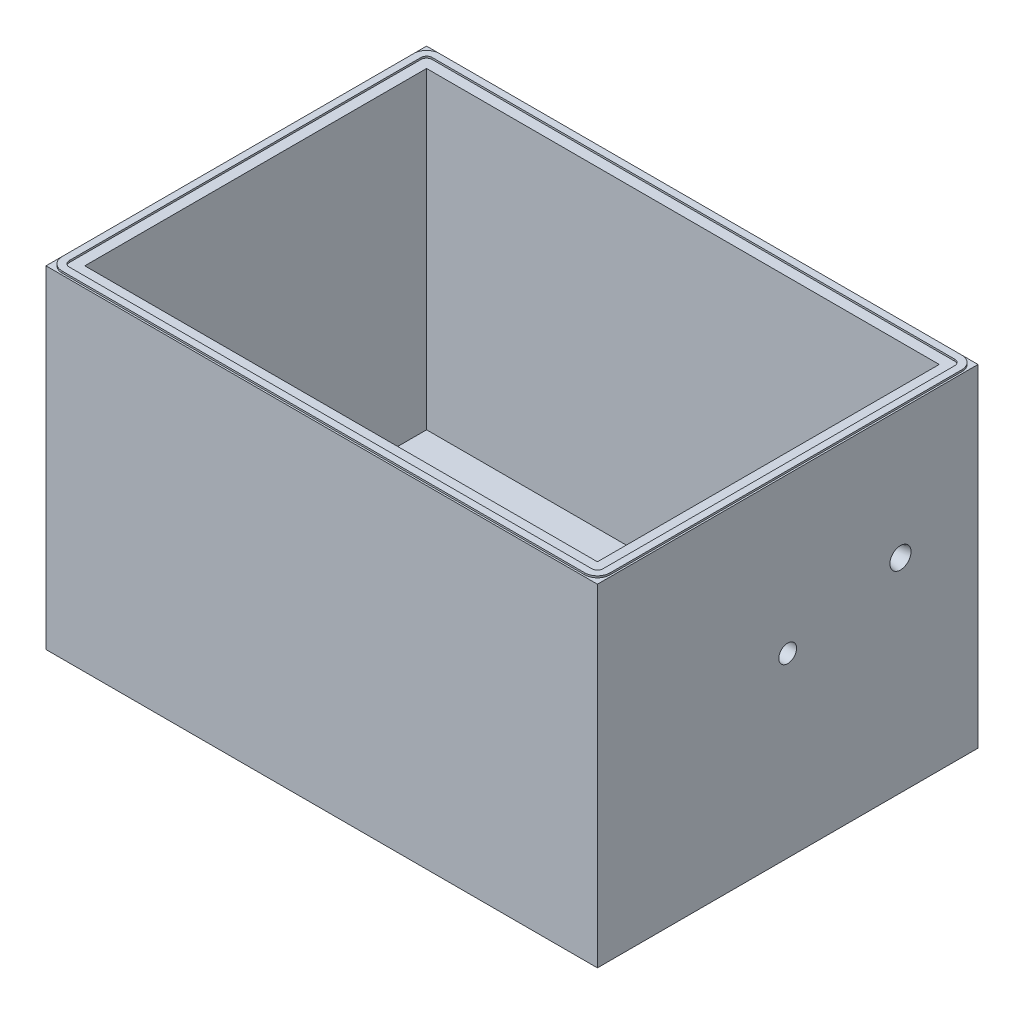
ISO-10303-21;
HEADER;
FILE_DESCRIPTION(('STEP AP214'),'2;1');
FILE_NAME('part.step','',(''),(''),'','','');
FILE_SCHEMA(('AUTOMOTIVE_DESIGN { 1 0 10303 214 1 1 1 1 }'));
ENDSEC;
DATA;
#1=APPLICATION_CONTEXT('core data for automotive mechanical design processes');
#2=APPLICATION_PROTOCOL_DEFINITION('international standard','automotive_design',2000,#1);
#3=PRODUCT_CONTEXT('',#1,'mechanical');
#4=PRODUCT('Part','Part','',(#3));
#5=PRODUCT_RELATED_PRODUCT_CATEGORY('part','',(#4));
#6=PRODUCT_DEFINITION_FORMATION('','',#4);
#7=PRODUCT_DEFINITION_CONTEXT('part definition',#1,'design');
#8=PRODUCT_DEFINITION('design','',#6,#7);
#9=PRODUCT_DEFINITION_SHAPE('','',#8);
#10=(LENGTH_UNIT() NAMED_UNIT(*) SI_UNIT(.MILLI.,.METRE.));
#11=(NAMED_UNIT(*) PLANE_ANGLE_UNIT() SI_UNIT($,.RADIAN.));
#12=(NAMED_UNIT(*) SI_UNIT($,.STERADIAN.) SOLID_ANGLE_UNIT());
#13=UNCERTAINTY_MEASURE_WITH_UNIT(LENGTH_MEASURE(1.E-05),#10,'distance_accuracy_value','');
#14=(GEOMETRIC_REPRESENTATION_CONTEXT(3) GLOBAL_UNCERTAINTY_ASSIGNED_CONTEXT((#13)) GLOBAL_UNIT_ASSIGNED_CONTEXT((#10,
#11,#12)) REPRESENTATION_CONTEXT('',''));
#15=CARTESIAN_POINT('',(0.,0.,0.));
#16=DIRECTION('',(0.,0.,1.));
#17=DIRECTION('',(1.,0.,0.));
#18=AXIS2_PLACEMENT_3D('',#15,#16,#17);
#19=CARTESIAN_POINT('',(0.,301.,0.));
#20=DIRECTION('',(0.,-1.,0.));
#21=DIRECTION('',(0.,0.,-1.));
#22=AXIS2_PLACEMENT_3D('',#19,#20,#21);
#23=PLANE('',#22);
#24=DIRECTION('',(-1.,0.,0.));
#25=VECTOR('',#24,1.);
#26=CARTESIAN_POINT('',(235.3945,301.,-163.5125));
#27=LINE('',#26,#25);
#28=CARTESIAN_POINT('',(235.3945,301.,-163.5125));
#29=VERTEX_POINT('',#28);
#30=CARTESIAN_POINT('',(-235.3945,301.,-163.5125));
#31=VERTEX_POINT('',#30);
#32=EDGE_CURVE('E330',#29,#31,#27,.T.);
#33=ORIENTED_EDGE('',*,*,#32,.F.);
#34=CARTESIAN_POINT('',(235.3945,301.,-158.4325));
#35=DIRECTION('',(0.,1.,0.));
#36=DIRECTION('',(0.,0.,-1.));
#37=AXIS2_PLACEMENT_3D('',#34,#35,#36);
#38=CIRCLE('',#37,5.08);
#39=CARTESIAN_POINT('',(240.4745,301.,-158.4325));
#40=VERTEX_POINT('',#39);
#41=EDGE_CURVE('E302',#40,#29,#38,.T.);
#42=ORIENTED_EDGE('',*,*,#41,.F.);
#43=DIRECTION('',(0.,0.,-1.));
#44=VECTOR('',#43,1.);
#45=CARTESIAN_POINT('',(240.4745,301.,158.4325));
#46=LINE('',#45,#44);
#47=CARTESIAN_POINT('',(240.4745,301.,158.4325));
#48=VERTEX_POINT('',#47);
#49=EDGE_CURVE('E307',#48,#40,#46,.T.);
#50=ORIENTED_EDGE('',*,*,#49,.F.);
#51=CARTESIAN_POINT('',(235.3945,301.,158.4325));
#52=DIRECTION('',(0.,1.,0.));
#53=DIRECTION('',(0.,0.,1.));
#54=AXIS2_PLACEMENT_3D('',#51,#52,#53);
#55=CIRCLE('',#54,5.07999999999997);
#56=CARTESIAN_POINT('',(235.3945,301.,163.5125));
#57=VERTEX_POINT('',#56);
#58=EDGE_CURVE('E345',#57,#48,#55,.T.);
#59=ORIENTED_EDGE('',*,*,#58,.F.);
#60=DIRECTION('',(1.,0.,0.));
#61=VECTOR('',#60,1.);
#62=CARTESIAN_POINT('',(-235.3945,301.,163.5125));
#63=LINE('',#62,#61);
#64=CARTESIAN_POINT('',(-235.3945,301.,163.5125));
#65=VERTEX_POINT('',#64);
#66=EDGE_CURVE('E342',#65,#57,#63,.T.);
#67=ORIENTED_EDGE('',*,*,#66,.F.);
#68=CARTESIAN_POINT('',(-235.3945,301.,158.4325));
#69=DIRECTION('',(0.,1.,0.));
#70=DIRECTION('',(0.,0.,1.));
#71=AXIS2_PLACEMENT_3D('',#68,#69,#70);
#72=CIRCLE('',#71,5.08);
#73=CARTESIAN_POINT('',(-240.4745,301.,158.4325));
#74=VERTEX_POINT('',#73);
#75=EDGE_CURVE('E339',#74,#65,#72,.T.);
#76=ORIENTED_EDGE('',*,*,#75,.F.);
#77=DIRECTION('',(0.,0.,1.));
#78=VECTOR('',#77,1.);
#79=CARTESIAN_POINT('',(-240.4745,301.,-158.4325));
#80=LINE('',#79,#78);
#81=CARTESIAN_POINT('',(-240.4745,301.,-158.4325));
#82=VERTEX_POINT('',#81);
#83=EDGE_CURVE('E336',#82,#74,#80,.T.);
#84=ORIENTED_EDGE('',*,*,#83,.F.);
#85=CARTESIAN_POINT('',(-235.3945,301.,-158.4325));
#86=DIRECTION('',(0.,1.,0.));
#87=DIRECTION('',(0.,0.,1.));
#88=AXIS2_PLACEMENT_3D('',#85,#86,#87);
#89=CIRCLE('',#88,5.08000000000002);
#90=EDGE_CURVE('E333',#31,#82,#89,.T.);
#91=ORIENTED_EDGE('',*,*,#90,.F.);
#92=EDGE_LOOP('',(#33,#42,#50,#59,#67,#76,#84,#91));
#93=FACE_BOUND('',#92,.T.);
#94=CARTESIAN_POINT('',(235.3945,301.,158.4325));
#95=DIRECTION('',(0.,1.,0.));
#96=DIRECTION('',(0.,0.,1.));
#97=AXIS2_PLACEMENT_3D('',#94,#95,#96);
#98=CIRCLE('',#97,11.43);
#99=CARTESIAN_POINT('',(235.3945,301.,169.8625));
#100=VERTEX_POINT('',#99);
#101=CARTESIAN_POINT('',(246.8245,301.,158.4325));
#102=VERTEX_POINT('',#101);
#103=EDGE_CURVE('E250',#100,#102,#98,.T.);
#104=ORIENTED_EDGE('',*,*,#103,.T.);
#105=DIRECTION('',(0.,0.,-1.));
#106=VECTOR('',#105,1.);
#107=CARTESIAN_POINT('',(246.8245,301.,158.4325));
#108=LINE('',#107,#106);
#109=CARTESIAN_POINT('',(246.8245,301.,-158.4325));
#110=VERTEX_POINT('',#109);
#111=EDGE_CURVE('E207',#102,#110,#108,.T.);
#112=ORIENTED_EDGE('',*,*,#111,.T.);
#113=CARTESIAN_POINT('',(235.3945,301.,-158.4325));
#114=DIRECTION('',(0.,1.,0.));
#115=DIRECTION('',(0.,0.,1.));
#116=AXIS2_PLACEMENT_3D('',#113,#114,#115);
#117=CIRCLE('',#116,11.43);
#118=CARTESIAN_POINT('',(235.3945,301.,-169.8625));
#119=VERTEX_POINT('',#118);
#120=EDGE_CURVE('E64',#110,#119,#117,.T.);
#121=ORIENTED_EDGE('',*,*,#120,.T.);
#122=DIRECTION('',(-1.,0.,0.));
#123=VECTOR('',#122,1.);
#124=CARTESIAN_POINT('',(235.3945,301.,-169.8625));
#125=LINE('',#124,#123);
#126=CARTESIAN_POINT('',(-235.3945,301.,-169.8625));
#127=VERTEX_POINT('',#126);
#128=EDGE_CURVE('E254',#119,#127,#125,.T.);
#129=ORIENTED_EDGE('',*,*,#128,.T.);
#130=CARTESIAN_POINT('',(-235.3945,301.,-158.4325));
#131=DIRECTION('',(0.,1.,0.));
#132=DIRECTION('',(0.,0.,1.));
#133=AXIS2_PLACEMENT_3D('',#130,#131,#132);
#134=CIRCLE('',#133,11.43);
#135=CARTESIAN_POINT('',(-246.8245,301.,-158.4325));
#136=VERTEX_POINT('',#135);
#137=EDGE_CURVE('E257',#127,#136,#134,.T.);
#138=ORIENTED_EDGE('',*,*,#137,.T.);
#139=DIRECTION('',(0.,0.,1.));
#140=VECTOR('',#139,1.);
#141=CARTESIAN_POINT('',(-246.8245,301.,-158.4325));
#142=LINE('',#141,#140);
#143=CARTESIAN_POINT('',(-246.8245,301.,158.4325));
#144=VERTEX_POINT('',#143);
#145=EDGE_CURVE('E260',#136,#144,#142,.T.);
#146=ORIENTED_EDGE('',*,*,#145,.T.);
#147=CARTESIAN_POINT('',(-235.3945,301.,158.4325));
#148=DIRECTION('',(0.,1.,0.));
#149=DIRECTION('',(0.,0.,1.));
#150=AXIS2_PLACEMENT_3D('',#147,#148,#149);
#151=CIRCLE('',#150,11.43);
#152=CARTESIAN_POINT('',(-235.3945,301.,169.8625));
#153=VERTEX_POINT('',#152);
#154=EDGE_CURVE('E230',#144,#153,#151,.T.);
#155=ORIENTED_EDGE('',*,*,#154,.T.);
#156=DIRECTION('',(1.,0.,0.));
#157=VECTOR('',#156,1.);
#158=CARTESIAN_POINT('',(-235.3945,301.,169.8625));
#159=LINE('',#158,#157);
#160=EDGE_CURVE('E227',#153,#100,#159,.T.);
#161=ORIENTED_EDGE('',*,*,#160,.T.);
#162=EDGE_LOOP('',(#104,#112,#121,#129,#138,#146,#155,#161));
#163=FACE_BOUND('',#162,.T.);
#164=ADVANCED_FACE('F41',(#93,#163),#23,.F.);
#165=CARTESIAN_POINT('',(248.412,17.4625,171.45));
#166=DIRECTION('',(-1.,0.,0.));
#167=DIRECTION('',(0.,0.,1.));
#168=AXIS2_PLACEMENT_3D('',#165,#166,#167);
#169=PLANE('',#168);
#170=CARTESIAN_POINT('',(248.412,159.7125,0.));
#171=DIRECTION('',(1.,0.,0.));
#172=DIRECTION('',(0.,0.,-1.));
#173=AXIS2_PLACEMENT_3D('',#170,#171,#172);
#174=CIRCLE('',#173,8.001);
#175=CARTESIAN_POINT('',(248.412,159.7125,-8.00100000000002));
#176=VERTEX_POINT('',#175);
#177=EDGE_CURVE('E433',#176,#176,#174,.T.);
#178=ORIENTED_EDGE('',*,*,#177,.F.);
#179=EDGE_LOOP('',(#178));
#180=FACE_BOUND('',#179,.T.);
#181=CARTESIAN_POINT('',(248.412,183.525,-101.6));
#182=DIRECTION('',(1.,0.,0.));
#183=DIRECTION('',(0.,0.,-1.));
#184=AXIS2_PLACEMENT_3D('',#181,#182,#183);
#185=CIRCLE('',#184,9.525);
#186=CARTESIAN_POINT('',(248.412,183.525,-111.125));
#187=VERTEX_POINT('',#186);
#188=EDGE_CURVE('E284',#187,#187,#185,.T.);
#189=ORIENTED_EDGE('',*,*,#188,.F.);
#190=EDGE_LOOP('',(#189));
#191=FACE_BOUND('',#190,.T.);
#192=DIRECTION('',(0.,-1.,0.));
#193=VECTOR('',#192,1.);
#194=CARTESIAN_POINT('',(248.412,17.4625,-171.45));
#195=LINE('',#194,#193);
#196=CARTESIAN_POINT('',(248.412,299.4125,-171.45));
#197=VERTEX_POINT('',#196);
#198=CARTESIAN_POINT('',(248.412,0.,-171.45));
#199=VERTEX_POINT('',#198);
#200=EDGE_CURVE('E11',#197,#199,#195,.T.);
#201=ORIENTED_EDGE('',*,*,#200,.F.);
#202=DIRECTION('',(0.,0.,-1.));
#203=VECTOR('',#202,1.);
#204=CARTESIAN_POINT('',(248.412,299.4125,-171.45));
#205=LINE('',#204,#203);
#206=CARTESIAN_POINT('',(248.412,299.4125,171.45));
#207=VERTEX_POINT('',#206);
#208=EDGE_CURVE('E279',#207,#197,#205,.T.);
#209=ORIENTED_EDGE('',*,*,#208,.F.);
#210=DIRECTION('',(0.,-1.,0.));
#211=VECTOR('',#210,1.);
#212=CARTESIAN_POINT('',(248.412,17.4625,171.45));
#213=LINE('',#212,#211);
#214=CARTESIAN_POINT('',(248.412,0.,171.45));
#215=VERTEX_POINT('',#214);
#216=EDGE_CURVE('E398',#207,#215,#213,.T.);
#217=ORIENTED_EDGE('',*,*,#216,.T.);
#218=DIRECTION('',(0.,0.,-1.));
#219=VECTOR('',#218,1.);
#220=CARTESIAN_POINT('',(248.412,0.,171.45));
#221=LINE('',#220,#219);
#222=EDGE_CURVE('E386',#215,#199,#221,.T.);
#223=ORIENTED_EDGE('',*,*,#222,.T.);
#224=EDGE_LOOP('',(#201,#209,#217,#223));
#225=FACE_BOUND('',#224,.T.);
#226=ADVANCED_FACE('F43',(#180,#191,#225),#169,.F.);
#227=CARTESIAN_POINT('',(-248.412,17.4625,-171.45));
#228=DIRECTION('',(0.,0.,1.));
#229=DIRECTION('',(1.,0.,0.));
#230=AXIS2_PLACEMENT_3D('',#227,#228,#229);
#231=PLANE('',#230);
#232=DIRECTION('',(0.,-1.,0.));
#233=VECTOR('',#232,1.);
#234=CARTESIAN_POINT('',(-248.412,17.4625,-171.45));
#235=LINE('',#234,#233);
#236=CARTESIAN_POINT('',(-248.412,299.4125,-171.45));
#237=VERTEX_POINT('',#236);
#238=CARTESIAN_POINT('',(-248.412,0.,-171.45));
#239=VERTEX_POINT('',#238);
#240=EDGE_CURVE('E49',#237,#239,#235,.T.);
#241=ORIENTED_EDGE('',*,*,#240,.F.);
#242=DIRECTION('',(-1.,0.,0.));
#243=VECTOR('',#242,1.);
#244=CARTESIAN_POINT('',(-248.412,299.4125,-171.45));
#245=LINE('',#244,#243);
#246=EDGE_CURVE('E281',#197,#237,#245,.T.);
#247=ORIENTED_EDGE('',*,*,#246,.F.);
#248=ORIENTED_EDGE('',*,*,#200,.T.);
#249=DIRECTION('',(-1.,0.,0.));
#250=VECTOR('',#249,1.);
#251=CARTESIAN_POINT('',(-248.412,0.,-171.45));
#252=LINE('',#251,#250);
#253=EDGE_CURVE('E389',#199,#239,#252,.T.);
#254=ORIENTED_EDGE('',*,*,#253,.T.);
#255=EDGE_LOOP('',(#241,#247,#248,#254));
#256=FACE_BOUND('',#255,.T.);
#257=ADVANCED_FACE('F410',(#256),#231,.F.);
#258=CARTESIAN_POINT('',(-248.412,17.4625,171.45));
#259=DIRECTION('',(1.,0.,0.));
#260=DIRECTION('',(0.,0.,-1.));
#261=AXIS2_PLACEMENT_3D('',#258,#259,#260);
#262=PLANE('',#261);
#263=DIRECTION('',(0.,-1.,0.));
#264=VECTOR('',#263,1.);
#265=CARTESIAN_POINT('',(-248.412,17.4625,171.45));
#266=LINE('',#265,#264);
#267=CARTESIAN_POINT('',(-248.412,299.4125,171.45));
#268=VERTEX_POINT('',#267);
#269=CARTESIAN_POINT('',(-248.412,0.,171.45));
#270=VERTEX_POINT('',#269);
#271=EDGE_CURVE('E400',#268,#270,#266,.T.);
#272=ORIENTED_EDGE('',*,*,#271,.F.);
#273=DIRECTION('',(0.,0.,1.));
#274=VECTOR('',#273,1.);
#275=CARTESIAN_POINT('',(-248.412,299.4125,171.45));
#276=LINE('',#275,#274);
#277=EDGE_CURVE('E56',#237,#268,#276,.T.);
#278=ORIENTED_EDGE('',*,*,#277,.F.);
#279=ORIENTED_EDGE('',*,*,#240,.T.);
#280=DIRECTION('',(0.,0.,1.));
#281=VECTOR('',#280,1.);
#282=CARTESIAN_POINT('',(-248.412,0.,171.45));
#283=LINE('',#282,#281);
#284=EDGE_CURVE('E392',#239,#270,#283,.T.);
#285=ORIENTED_EDGE('',*,*,#284,.T.);
#286=EDGE_LOOP('',(#272,#278,#279,#285));
#287=FACE_BOUND('',#286,.T.);
#288=ADVANCED_FACE('F404',(#287),#262,.F.);
#289=CARTESIAN_POINT('',(-248.412,17.4625,171.45));
#290=DIRECTION('',(0.,0.,-1.));
#291=DIRECTION('',(-1.,0.,0.));
#292=AXIS2_PLACEMENT_3D('',#289,#290,#291);
#293=PLANE('',#292);
#294=ORIENTED_EDGE('',*,*,#216,.F.);
#295=DIRECTION('',(1.,0.,0.));
#296=VECTOR('',#295,1.);
#297=CARTESIAN_POINT('',(248.412,299.4125,171.45));
#298=LINE('',#297,#296);
#299=EDGE_CURVE('E266',#268,#207,#298,.T.);
#300=ORIENTED_EDGE('',*,*,#299,.F.);
#301=ORIENTED_EDGE('',*,*,#271,.T.);
#302=DIRECTION('',(1.,0.,0.));
#303=VECTOR('',#302,1.);
#304=CARTESIAN_POINT('',(-248.412,0.,171.45));
#305=LINE('',#304,#303);
#306=EDGE_CURVE('E395',#270,#215,#305,.T.);
#307=ORIENTED_EDGE('',*,*,#306,.T.);
#308=EDGE_LOOP('',(#294,#300,#301,#307));
#309=FACE_BOUND('',#308,.T.);
#310=ADVANCED_FACE('F417',(#309),#293,.F.);
#311=CARTESIAN_POINT('',(0.,0.,0.));
#312=DIRECTION('',(0.,-1.,0.));
#313=DIRECTION('',(0.,0.,-1.));
#314=AXIS2_PLACEMENT_3D('',#311,#312,#313);
#315=PLANE('',#314);
#316=ORIENTED_EDGE('',*,*,#222,.F.);
#317=ORIENTED_EDGE('',*,*,#306,.F.);
#318=ORIENTED_EDGE('',*,*,#284,.F.);
#319=ORIENTED_EDGE('',*,*,#253,.F.);
#320=EDGE_LOOP('',(#316,#317,#318,#319));
#321=FACE_BOUND('',#320,.T.);
#322=ADVANCED_FACE('F414',(#321),#315,.T.);
#323=CARTESIAN_POINT('',(235.3945,299.4125,-158.4325));
#324=DIRECTION('',(0.,1.,0.));
#325=DIRECTION('',(0.,0.,1.));
#326=AXIS2_PLACEMENT_3D('',#323,#324,#325);
#327=CYLINDRICAL_SURFACE('',#326,5.08);
#328=ORIENTED_EDGE('',*,*,#41,.T.);
#329=DIRECTION('',(0.,1.,0.));
#330=VECTOR('',#329,1.);
#331=CARTESIAN_POINT('',(235.3945,299.4125,-163.5125));
#332=LINE('',#331,#330);
#333=CARTESIAN_POINT('',(235.3945,299.4125,-163.5125));
#334=VERTEX_POINT('',#333);
#335=EDGE_CURVE('E328',#334,#29,#332,.T.);
#336=ORIENTED_EDGE('',*,*,#335,.F.);
#337=CARTESIAN_POINT('',(235.3945,299.4125,-158.4325));
#338=DIRECTION('',(0.,1.,0.));
#339=DIRECTION('',(0.,0.,-1.));
#340=AXIS2_PLACEMENT_3D('',#337,#338,#339);
#341=CIRCLE('',#340,5.08);
#342=CARTESIAN_POINT('',(240.4745,299.4125,-158.4325));
#343=VERTEX_POINT('',#342);
#344=EDGE_CURVE('E303',#343,#334,#341,.T.);
#345=ORIENTED_EDGE('',*,*,#344,.F.);
#346=DIRECTION('',(0.,1.,0.));
#347=VECTOR('',#346,1.);
#348=CARTESIAN_POINT('',(240.4745,299.4125,-158.4325));
#349=LINE('',#348,#347);
#350=EDGE_CURVE('E350',#343,#40,#349,.T.);
#351=ORIENTED_EDGE('',*,*,#350,.T.);
#352=EDGE_LOOP('',(#328,#336,#345,#351));
#353=FACE_BOUND('',#352,.T.);
#354=ADVANCED_FACE('F477',(#353),#327,.F.);
#355=CARTESIAN_POINT('',(240.4745,299.4125,158.4325));
#356=DIRECTION('',(1.,0.,0.));
#357=DIRECTION('',(0.,0.,-1.));
#358=AXIS2_PLACEMENT_3D('',#355,#356,#357);
#359=PLANE('',#358);
#360=ORIENTED_EDGE('',*,*,#49,.T.);
#361=ORIENTED_EDGE('',*,*,#350,.F.);
#362=DIRECTION('',(0.,0.,-1.));
#363=VECTOR('',#362,1.);
#364=CARTESIAN_POINT('',(240.4745,299.4125,158.4325));
#365=LINE('',#364,#363);
#366=CARTESIAN_POINT('',(240.4745,299.4125,158.4325));
#367=VERTEX_POINT('',#366);
#368=EDGE_CURVE('E325',#367,#343,#365,.T.);
#369=ORIENTED_EDGE('',*,*,#368,.F.);
#370=DIRECTION('',(0.,1.,0.));
#371=VECTOR('',#370,1.);
#372=CARTESIAN_POINT('',(240.4745,299.4125,158.4325));
#373=LINE('',#372,#371);
#374=EDGE_CURVE('E353',#367,#48,#373,.T.);
#375=ORIENTED_EDGE('',*,*,#374,.T.);
#376=EDGE_LOOP('',(#360,#361,#369,#375));
#377=FACE_BOUND('',#376,.T.);
#378=ADVANCED_FACE('F596',(#377),#359,.F.);
#379=CARTESIAN_POINT('',(235.3945,299.4125,158.4325));
#380=DIRECTION('',(0.,1.,0.));
#381=DIRECTION('',(0.,0.,1.));
#382=AXIS2_PLACEMENT_3D('',#379,#380,#381);
#383=CYLINDRICAL_SURFACE('',#382,5.07999999999997);
#384=ORIENTED_EDGE('',*,*,#58,.T.);
#385=ORIENTED_EDGE('',*,*,#374,.F.);
#386=CARTESIAN_POINT('',(235.3945,299.4125,158.4325));
#387=DIRECTION('',(0.,1.,0.));
#388=DIRECTION('',(0.,0.,1.));
#389=AXIS2_PLACEMENT_3D('',#386,#387,#388);
#390=CIRCLE('',#389,5.07999999999997);
#391=CARTESIAN_POINT('',(235.3945,299.4125,163.5125));
#392=VERTEX_POINT('',#391);
#393=EDGE_CURVE('E322',#392,#367,#390,.T.);
#394=ORIENTED_EDGE('',*,*,#393,.F.);
#395=DIRECTION('',(0.,1.,0.));
#396=VECTOR('',#395,1.);
#397=CARTESIAN_POINT('',(235.3945,299.4125,163.5125));
#398=LINE('',#397,#396);
#399=EDGE_CURVE('E355',#392,#57,#398,.T.);
#400=ORIENTED_EDGE('',*,*,#399,.T.);
#401=EDGE_LOOP('',(#384,#385,#394,#400));
#402=FACE_BOUND('',#401,.T.);
#403=ADVANCED_FACE('F606',(#402),#383,.F.);
#404=CARTESIAN_POINT('',(-235.3945,299.4125,163.5125));
#405=DIRECTION('',(0.,0.,1.));
#406=DIRECTION('',(1.,0.,0.));
#407=AXIS2_PLACEMENT_3D('',#404,#405,#406);
#408=PLANE('',#407);
#409=ORIENTED_EDGE('',*,*,#66,.T.);
#410=ORIENTED_EDGE('',*,*,#399,.F.);
#411=DIRECTION('',(1.,0.,0.));
#412=VECTOR('',#411,1.);
#413=CARTESIAN_POINT('',(-235.3945,299.4125,163.5125));
#414=LINE('',#413,#412);
#415=CARTESIAN_POINT('',(-235.3945,299.4125,163.5125));
#416=VERTEX_POINT('',#415);
#417=EDGE_CURVE('E319',#416,#392,#414,.T.);
#418=ORIENTED_EDGE('',*,*,#417,.F.);
#419=DIRECTION('',(0.,1.,0.));
#420=VECTOR('',#419,1.);
#421=CARTESIAN_POINT('',(-235.3945,299.4125,163.5125));
#422=LINE('',#421,#420);
#423=EDGE_CURVE('E357',#416,#65,#422,.T.);
#424=ORIENTED_EDGE('',*,*,#423,.T.);
#425=EDGE_LOOP('',(#409,#410,#418,#424));
#426=FACE_BOUND('',#425,.T.);
#427=ADVANCED_FACE('F616',(#426),#408,.F.);
#428=CARTESIAN_POINT('',(-235.3945,299.4125,158.4325));
#429=DIRECTION('',(0.,1.,0.));
#430=DIRECTION('',(0.,0.,1.));
#431=AXIS2_PLACEMENT_3D('',#428,#429,#430);
#432=CYLINDRICAL_SURFACE('',#431,5.08);
#433=ORIENTED_EDGE('',*,*,#75,.T.);
#434=ORIENTED_EDGE('',*,*,#423,.F.);
#435=CARTESIAN_POINT('',(-235.3945,299.4125,158.4325));
#436=DIRECTION('',(0.,1.,0.));
#437=DIRECTION('',(0.,0.,1.));
#438=AXIS2_PLACEMENT_3D('',#435,#436,#437);
#439=CIRCLE('',#438,5.08);
#440=CARTESIAN_POINT('',(-240.4745,299.4125,158.4325));
#441=VERTEX_POINT('',#440);
#442=EDGE_CURVE('E316',#441,#416,#439,.T.);
#443=ORIENTED_EDGE('',*,*,#442,.F.);
#444=DIRECTION('',(0.,1.,0.));
#445=VECTOR('',#444,1.);
#446=CARTESIAN_POINT('',(-240.4745,299.4125,158.4325));
#447=LINE('',#446,#445);
#448=EDGE_CURVE('E359',#441,#74,#447,.T.);
#449=ORIENTED_EDGE('',*,*,#448,.T.);
#450=EDGE_LOOP('',(#433,#434,#443,#449));
#451=FACE_BOUND('',#450,.T.);
#452=ADVANCED_FACE('F626',(#451),#432,.F.);
#453=CARTESIAN_POINT('',(-240.4745,299.4125,-158.4325));
#454=DIRECTION('',(-1.,0.,0.));
#455=DIRECTION('',(0.,0.,1.));
#456=AXIS2_PLACEMENT_3D('',#453,#454,#455);
#457=PLANE('',#456);
#458=ORIENTED_EDGE('',*,*,#83,.T.);
#459=ORIENTED_EDGE('',*,*,#448,.F.);
#460=DIRECTION('',(0.,0.,1.));
#461=VECTOR('',#460,1.);
#462=CARTESIAN_POINT('',(-240.4745,299.4125,-158.4325));
#463=LINE('',#462,#461);
#464=CARTESIAN_POINT('',(-240.4745,299.4125,-158.4325));
#465=VERTEX_POINT('',#464);
#466=EDGE_CURVE('E313',#465,#441,#463,.T.);
#467=ORIENTED_EDGE('',*,*,#466,.F.);
#468=DIRECTION('',(0.,1.,0.));
#469=VECTOR('',#468,1.);
#470=CARTESIAN_POINT('',(-240.4745,299.4125,-158.4325));
#471=LINE('',#470,#469);
#472=EDGE_CURVE('E361',#465,#82,#471,.T.);
#473=ORIENTED_EDGE('',*,*,#472,.T.);
#474=EDGE_LOOP('',(#458,#459,#467,#473));
#475=FACE_BOUND('',#474,.T.);
#476=ADVANCED_FACE('F636',(#475),#457,.F.);
#477=CARTESIAN_POINT('',(-235.3945,299.4125,-158.4325));
#478=DIRECTION('',(0.,1.,0.));
#479=DIRECTION('',(0.,0.,1.));
#480=AXIS2_PLACEMENT_3D('',#477,#478,#479);
#481=CYLINDRICAL_SURFACE('',#480,5.08000000000002);
#482=ORIENTED_EDGE('',*,*,#90,.T.);
#483=ORIENTED_EDGE('',*,*,#472,.F.);
#484=CARTESIAN_POINT('',(-235.3945,299.4125,-158.4325));
#485=DIRECTION('',(0.,1.,0.));
#486=DIRECTION('',(0.,0.,1.));
#487=AXIS2_PLACEMENT_3D('',#484,#485,#486);
#488=CIRCLE('',#487,5.08000000000002);
#489=CARTESIAN_POINT('',(-235.3945,299.4125,-163.5125));
#490=VERTEX_POINT('',#489);
#491=EDGE_CURVE('E310',#490,#465,#488,.T.);
#492=ORIENTED_EDGE('',*,*,#491,.F.);
#493=DIRECTION('',(0.,1.,0.));
#494=VECTOR('',#493,1.);
#495=CARTESIAN_POINT('',(-235.3945,299.4125,-163.5125));
#496=LINE('',#495,#494);
#497=EDGE_CURVE('E363',#490,#31,#496,.T.);
#498=ORIENTED_EDGE('',*,*,#497,.T.);
#499=EDGE_LOOP('',(#482,#483,#492,#498));
#500=FACE_BOUND('',#499,.T.);
#501=ADVANCED_FACE('F646',(#500),#481,.F.);
#502=CARTESIAN_POINT('',(235.3945,299.4125,-163.5125));
#503=DIRECTION('',(0.,0.,-1.));
#504=DIRECTION('',(-1.,0.,0.));
#505=AXIS2_PLACEMENT_3D('',#502,#503,#504);
#506=PLANE('',#505);
#507=ORIENTED_EDGE('',*,*,#32,.T.);
#508=ORIENTED_EDGE('',*,*,#497,.F.);
#509=DIRECTION('',(-1.,0.,0.));
#510=VECTOR('',#509,1.);
#511=CARTESIAN_POINT('',(235.3945,299.4125,-163.5125));
#512=LINE('',#511,#510);
#513=EDGE_CURVE('E306',#334,#490,#512,.T.);
#514=ORIENTED_EDGE('',*,*,#513,.F.);
#515=ORIENTED_EDGE('',*,*,#335,.T.);
#516=EDGE_LOOP('',(#507,#508,#514,#515));
#517=FACE_BOUND('',#516,.T.);
#518=ADVANCED_FACE('F656',(#517),#506,.F.);
#519=CARTESIAN_POINT('',(235.3945,299.4125,-158.4325));
#520=DIRECTION('',(0.,-1.,0.));
#521=DIRECTION('',(0.,0.,-1.));
#522=AXIS2_PLACEMENT_3D('',#519,#520,#521);
#523=PLANE('',#522);
#524=DIRECTION('',(0.,0.,1.));
#525=VECTOR('',#524,1.);
#526=CARTESIAN_POINT('',(-230.9495,299.4125,-153.9875));
#527=LINE('',#526,#525);
#528=CARTESIAN_POINT('',(-230.9495,299.4125,-153.9875));
#529=VERTEX_POINT('',#528);
#530=CARTESIAN_POINT('',(-230.9495,299.4125,153.9875));
#531=VERTEX_POINT('',#530);
#532=EDGE_CURVE('E290',#529,#531,#527,.T.);
#533=ORIENTED_EDGE('',*,*,#532,.F.);
#534=DIRECTION('',(-1.,0.,0.));
#535=VECTOR('',#534,1.);
#536=CARTESIAN_POINT('',(230.9495,299.4125,-153.9875));
#537=LINE('',#536,#535);
#538=CARTESIAN_POINT('',(230.9495,299.4125,-153.9875));
#539=VERTEX_POINT('',#538);
#540=EDGE_CURVE('E299',#539,#529,#537,.T.);
#541=ORIENTED_EDGE('',*,*,#540,.F.);
#542=DIRECTION('',(0.,0.,-1.));
#543=VECTOR('',#542,1.);
#544=CARTESIAN_POINT('',(230.9495,299.4125,153.9875));
#545=LINE('',#544,#543);
#546=CARTESIAN_POINT('',(230.9495,299.4125,153.9875));
#547=VERTEX_POINT('',#546);
#548=EDGE_CURVE('E296',#547,#539,#545,.T.);
#549=ORIENTED_EDGE('',*,*,#548,.F.);
#550=DIRECTION('',(1.,0.,0.));
#551=VECTOR('',#550,1.);
#552=CARTESIAN_POINT('',(-230.9495,299.4125,153.9875));
#553=LINE('',#552,#551);
#554=EDGE_CURVE('E293',#531,#547,#553,.T.);
#555=ORIENTED_EDGE('',*,*,#554,.F.);
#556=EDGE_LOOP('',(#533,#541,#549,#555));
#557=FACE_BOUND('',#556,.T.);
#558=ORIENTED_EDGE('',*,*,#344,.T.);
#559=ORIENTED_EDGE('',*,*,#513,.T.);
#560=ORIENTED_EDGE('',*,*,#491,.T.);
#561=ORIENTED_EDGE('',*,*,#466,.T.);
#562=ORIENTED_EDGE('',*,*,#442,.T.);
#563=ORIENTED_EDGE('',*,*,#417,.T.);
#564=ORIENTED_EDGE('',*,*,#393,.T.);
#565=ORIENTED_EDGE('',*,*,#368,.T.);
#566=EDGE_LOOP('',(#558,#559,#560,#561,#562,#563,#564,#565));
#567=FACE_BOUND('',#566,.T.);
#568=ADVANCED_FACE('F462',(#557,#567),#523,.F.);
#569=CARTESIAN_POINT('',(0.,17.4625,0.));
#570=DIRECTION('',(0.,-1.,0.));
#571=DIRECTION('',(0.,0.,-1.));
#572=AXIS2_PLACEMENT_3D('',#569,#570,#571);
#573=PLANE('',#572);
#574=DIRECTION('',(1.,0.,0.));
#575=VECTOR('',#574,1.);
#576=CARTESIAN_POINT('',(0.,17.4625,-153.9875));
#577=LINE('',#576,#575);
#578=CARTESIAN_POINT('',(-230.9495,17.4625,-153.9875));
#579=VERTEX_POINT('',#578);
#580=CARTESIAN_POINT('',(230.9495,17.4625,-153.9875));
#581=VERTEX_POINT('',#580);
#582=EDGE_CURVE('E383',#579,#581,#577,.T.);
#583=ORIENTED_EDGE('',*,*,#582,.F.);
#584=DIRECTION('',(0.,0.,-1.));
#585=VECTOR('',#584,1.);
#586=CARTESIAN_POINT('',(-230.9495,17.4625,0.));
#587=LINE('',#586,#585);
#588=CARTESIAN_POINT('',(-230.9495,17.4625,153.9875));
#589=VERTEX_POINT('',#588);
#590=EDGE_CURVE('E380',#589,#579,#587,.T.);
#591=ORIENTED_EDGE('',*,*,#590,.F.);
#592=DIRECTION('',(-1.,0.,0.));
#593=VECTOR('',#592,1.);
#594=CARTESIAN_POINT('',(0.,17.4625,153.9875));
#595=LINE('',#594,#593);
#596=CARTESIAN_POINT('',(230.9495,17.4625,153.9875));
#597=VERTEX_POINT('',#596);
#598=EDGE_CURVE('E377',#597,#589,#595,.T.);
#599=ORIENTED_EDGE('',*,*,#598,.F.);
#600=DIRECTION('',(0.,0.,1.));
#601=VECTOR('',#600,1.);
#602=CARTESIAN_POINT('',(230.9495,17.4625,0.));
#603=LINE('',#602,#601);
#604=EDGE_CURVE('E369',#581,#597,#603,.T.);
#605=ORIENTED_EDGE('',*,*,#604,.F.);
#606=EDGE_LOOP('',(#583,#591,#599,#605));
#607=FACE_BOUND('',#606,.T.);
#608=ADVANCED_FACE('F446',(#607),#573,.F.);
#609=CARTESIAN_POINT('',(230.9495,301.,0.));
#610=DIRECTION('',(1.,0.,0.));
#611=DIRECTION('',(0.,0.,-1.));
#612=AXIS2_PLACEMENT_3D('',#609,#610,#611);
#613=PLANE('',#612);
#614=CARTESIAN_POINT('',(230.9495,159.7125,0.));
#615=DIRECTION('',(1.,0.,0.));
#616=DIRECTION('',(0.,0.,-1.));
#617=AXIS2_PLACEMENT_3D('',#614,#615,#616);
#618=CIRCLE('',#617,8.001);
#619=CARTESIAN_POINT('',(230.9495,159.7125,-8.00100000000002));
#620=VERTEX_POINT('',#619);
#621=EDGE_CURVE('E233',#620,#620,#618,.F.);
#622=ORIENTED_EDGE('',*,*,#621,.F.);
#623=EDGE_LOOP('',(#622));
#624=FACE_BOUND('',#623,.T.);
#625=CARTESIAN_POINT('',(230.9495,183.525,-101.6));
#626=DIRECTION('',(1.,0.,0.));
#627=DIRECTION('',(0.,0.,-1.));
#628=AXIS2_PLACEMENT_3D('',#625,#626,#627);
#629=CIRCLE('',#628,6.35026651287884);
#630=CARTESIAN_POINT('',(230.9495,183.525,-107.950266512879));
#631=VERTEX_POINT('',#630);
#632=EDGE_CURVE('E287',#631,#631,#629,.F.);
#633=ORIENTED_EDGE('',*,*,#632,.F.);
#634=EDGE_LOOP('',(#633));
#635=FACE_BOUND('',#634,.T.);
#636=DIRECTION('',(0.,-1.,0.));
#637=VECTOR('',#636,1.);
#638=CARTESIAN_POINT('',(230.9495,301.,153.9875));
#639=LINE('',#638,#637);
#640=EDGE_CURVE('E372',#547,#597,#639,.T.);
#641=ORIENTED_EDGE('',*,*,#640,.F.);
#642=ORIENTED_EDGE('',*,*,#548,.T.);
#643=DIRECTION('',(0.,-1.,0.));
#644=VECTOR('',#643,1.);
#645=CARTESIAN_POINT('',(230.9495,301.,-153.9875));
#646=LINE('',#645,#644);
#647=EDGE_CURVE('E352',#539,#581,#646,.T.);
#648=ORIENTED_EDGE('',*,*,#647,.T.);
#649=ORIENTED_EDGE('',*,*,#604,.T.);
#650=EDGE_LOOP('',(#641,#642,#648,#649));
#651=FACE_BOUND('',#650,.T.);
#652=ADVANCED_FACE('F443',(#624,#635,#651),#613,.F.);
#653=CARTESIAN_POINT('',(0.,301.,153.9875));
#654=DIRECTION('',(0.,0.,1.));
#655=DIRECTION('',(1.,0.,0.));
#656=AXIS2_PLACEMENT_3D('',#653,#654,#655);
#657=PLANE('',#656);
#658=DIRECTION('',(0.,-1.,0.));
#659=VECTOR('',#658,1.);
#660=CARTESIAN_POINT('',(-230.9495,301.,153.9875));
#661=LINE('',#660,#659);
#662=EDGE_CURVE('E370',#531,#589,#661,.T.);
#663=ORIENTED_EDGE('',*,*,#662,.F.);
#664=ORIENTED_EDGE('',*,*,#554,.T.);
#665=ORIENTED_EDGE('',*,*,#640,.T.);
#666=ORIENTED_EDGE('',*,*,#598,.T.);
#667=EDGE_LOOP('',(#663,#664,#665,#666));
#668=FACE_BOUND('',#667,.T.);
#669=ADVANCED_FACE('F445',(#668),#657,.F.);
#670=CARTESIAN_POINT('',(-230.9495,301.,0.));
#671=DIRECTION('',(-1.,0.,0.));
#672=DIRECTION('',(0.,0.,1.));
#673=AXIS2_PLACEMENT_3D('',#670,#671,#672);
#674=PLANE('',#673);
#675=DIRECTION('',(0.,-1.,0.));
#676=VECTOR('',#675,1.);
#677=CARTESIAN_POINT('',(-230.9495,301.,-153.9875));
#678=LINE('',#677,#676);
#679=EDGE_CURVE('E367',#529,#579,#678,.T.);
#680=ORIENTED_EDGE('',*,*,#679,.F.);
#681=ORIENTED_EDGE('',*,*,#532,.T.);
#682=ORIENTED_EDGE('',*,*,#662,.T.);
#683=ORIENTED_EDGE('',*,*,#590,.T.);
#684=EDGE_LOOP('',(#680,#681,#682,#683));
#685=FACE_BOUND('',#684,.T.);
#686=ADVANCED_FACE('F460',(#685),#674,.F.);
#687=CARTESIAN_POINT('',(0.,301.,-153.9875));
#688=DIRECTION('',(0.,0.,-1.));
#689=DIRECTION('',(-1.,0.,0.));
#690=AXIS2_PLACEMENT_3D('',#687,#688,#689);
#691=PLANE('',#690);
#692=ORIENTED_EDGE('',*,*,#647,.F.);
#693=ORIENTED_EDGE('',*,*,#540,.T.);
#694=ORIENTED_EDGE('',*,*,#679,.T.);
#695=ORIENTED_EDGE('',*,*,#582,.T.);
#696=EDGE_LOOP('',(#692,#693,#694,#695));
#697=FACE_BOUND('',#696,.T.);
#698=ADVANCED_FACE('F439',(#697),#691,.F.);
#699=CARTESIAN_POINT('',(248.412,183.525,-101.6));
#700=DIRECTION('',(1.,0.,0.));
#701=DIRECTION('',(0.,0.,-1.));
#702=AXIS2_PLACEMENT_3D('',#699,#700,#701);
#703=CONICAL_SURFACE('',#702,9.525,0.179838726125496);
#704=ORIENTED_EDGE('',*,*,#188,.T.);
#705=EDGE_LOOP('',(#704));
#706=FACE_BOUND('',#705,.T.);
#707=ORIENTED_EDGE('',*,*,#632,.T.);
#708=EDGE_LOOP('',(#707));
#709=FACE_BOUND('',#708,.T.);
#710=ADVANCED_FACE('F436',(#706,#709),#703,.F.);
#711=CARTESIAN_POINT('',(0.,299.4125,0.));
#712=DIRECTION('',(0.,-1.,0.));
#713=DIRECTION('',(0.,0.,-1.));
#714=AXIS2_PLACEMENT_3D('',#711,#712,#713);
#715=PLANE('',#714);
#716=CARTESIAN_POINT('',(235.3945,299.4125,158.4325));
#717=DIRECTION('',(0.,1.,0.));
#718=DIRECTION('',(0.,0.,1.));
#719=AXIS2_PLACEMENT_3D('',#716,#717,#718);
#720=CIRCLE('',#719,11.43);
#721=CARTESIAN_POINT('',(235.3945,299.4125,169.8625));
#722=VERTEX_POINT('',#721);
#723=CARTESIAN_POINT('',(246.8245,299.4125,158.4325));
#724=VERTEX_POINT('',#723);
#725=EDGE_CURVE('E219',#722,#724,#720,.T.);
#726=ORIENTED_EDGE('',*,*,#725,.F.);
#727=DIRECTION('',(1.,0.,0.));
#728=VECTOR('',#727,1.);
#729=CARTESIAN_POINT('',(-235.3945,299.4125,169.8625));
#730=LINE('',#729,#728);
#731=CARTESIAN_POINT('',(-235.3945,299.4125,169.8625));
#732=VERTEX_POINT('',#731);
#733=EDGE_CURVE('E213',#732,#722,#730,.T.);
#734=ORIENTED_EDGE('',*,*,#733,.F.);
#735=CARTESIAN_POINT('',(-235.3945,299.4125,158.4325));
#736=DIRECTION('',(0.,1.,0.));
#737=DIRECTION('',(0.,0.,1.));
#738=AXIS2_PLACEMENT_3D('',#735,#736,#737);
#739=CIRCLE('',#738,11.43);
#740=CARTESIAN_POINT('',(-246.8245,299.4125,158.4325));
#741=VERTEX_POINT('',#740);
#742=EDGE_CURVE('E246',#741,#732,#739,.T.);
#743=ORIENTED_EDGE('',*,*,#742,.F.);
#744=DIRECTION('',(0.,0.,1.));
#745=VECTOR('',#744,1.);
#746=CARTESIAN_POINT('',(-246.8245,299.4125,-158.4325));
#747=LINE('',#746,#745);
#748=CARTESIAN_POINT('',(-246.8245,299.4125,-158.4325));
#749=VERTEX_POINT('',#748);
#750=EDGE_CURVE('E243',#749,#741,#747,.T.);
#751=ORIENTED_EDGE('',*,*,#750,.F.);
#752=CARTESIAN_POINT('',(-235.3945,299.4125,-158.4325));
#753=DIRECTION('',(0.,1.,0.));
#754=DIRECTION('',(0.,0.,1.));
#755=AXIS2_PLACEMENT_3D('',#752,#753,#754);
#756=CIRCLE('',#755,11.43);
#757=CARTESIAN_POINT('',(-235.3945,299.4125,-169.8625));
#758=VERTEX_POINT('',#757);
#759=EDGE_CURVE('E240',#758,#749,#756,.T.);
#760=ORIENTED_EDGE('',*,*,#759,.F.);
#761=DIRECTION('',(-1.,0.,0.));
#762=VECTOR('',#761,1.);
#763=CARTESIAN_POINT('',(235.3945,299.4125,-169.8625));
#764=LINE('',#763,#762);
#765=CARTESIAN_POINT('',(235.3945,299.4125,-169.8625));
#766=VERTEX_POINT('',#765);
#767=EDGE_CURVE('E237',#766,#758,#764,.T.);
#768=ORIENTED_EDGE('',*,*,#767,.F.);
#769=CARTESIAN_POINT('',(235.3945,299.4125,-158.4325));
#770=DIRECTION('',(0.,1.,0.));
#771=DIRECTION('',(0.,0.,1.));
#772=AXIS2_PLACEMENT_3D('',#769,#770,#771);
#773=CIRCLE('',#772,11.43);
#774=CARTESIAN_POINT('',(246.8245,299.4125,-158.4325));
#775=VERTEX_POINT('',#774);
#776=EDGE_CURVE('E223',#775,#766,#773,.T.);
#777=ORIENTED_EDGE('',*,*,#776,.F.);
#778=DIRECTION('',(0.,0.,-1.));
#779=VECTOR('',#778,1.);
#780=CARTESIAN_POINT('',(246.8245,299.4125,158.4325));
#781=LINE('',#780,#779);
#782=EDGE_CURVE('E205',#724,#775,#781,.T.);
#783=ORIENTED_EDGE('',*,*,#782,.F.);
#784=EDGE_LOOP('',(#726,#734,#743,#751,#760,#768,#777,#783));
#785=FACE_BOUND('',#784,.T.);
#786=ORIENTED_EDGE('',*,*,#299,.T.);
#787=ORIENTED_EDGE('',*,*,#208,.T.);
#788=ORIENTED_EDGE('',*,*,#246,.T.);
#789=ORIENTED_EDGE('',*,*,#277,.T.);
#790=EDGE_LOOP('',(#786,#787,#788,#789));
#791=FACE_BOUND('',#790,.T.);
#792=ADVANCED_FACE('F217',(#785,#791),#715,.F.);
#793=CARTESIAN_POINT('',(235.3945,299.4125,158.4325));
#794=DIRECTION('',(0.,1.,0.));
#795=DIRECTION('',(0.,0.,1.));
#796=AXIS2_PLACEMENT_3D('',#793,#794,#795);
#797=CYLINDRICAL_SURFACE('',#796,11.43);
#798=ORIENTED_EDGE('',*,*,#103,.F.);
#799=DIRECTION('',(0.,1.,0.));
#800=VECTOR('',#799,1.);
#801=CARTESIAN_POINT('',(235.3945,299.4125,169.8625));
#802=LINE('',#801,#800);
#803=EDGE_CURVE('E226',#722,#100,#802,.T.);
#804=ORIENTED_EDGE('',*,*,#803,.F.);
#805=ORIENTED_EDGE('',*,*,#725,.T.);
#806=DIRECTION('',(0.,1.,0.));
#807=VECTOR('',#806,1.);
#808=CARTESIAN_POINT('',(246.8245,299.4125,158.4325));
#809=LINE('',#808,#807);
#810=EDGE_CURVE('E202',#724,#102,#809,.T.);
#811=ORIENTED_EDGE('',*,*,#810,.T.);
#812=EDGE_LOOP('',(#798,#804,#805,#811));
#813=FACE_BOUND('',#812,.T.);
#814=ADVANCED_FACE('F225',(#813),#797,.T.);
#815=CARTESIAN_POINT('',(-235.3945,299.4125,169.8625));
#816=DIRECTION('',(0.,0.,1.));
#817=DIRECTION('',(1.,0.,0.));
#818=AXIS2_PLACEMENT_3D('',#815,#816,#817);
#819=PLANE('',#818);
#820=ORIENTED_EDGE('',*,*,#160,.F.);
#821=DIRECTION('',(0.,1.,0.));
#822=VECTOR('',#821,1.);
#823=CARTESIAN_POINT('',(-235.3945,299.4125,169.8625));
#824=LINE('',#823,#822);
#825=EDGE_CURVE('E267',#732,#153,#824,.T.);
#826=ORIENTED_EDGE('',*,*,#825,.F.);
#827=ORIENTED_EDGE('',*,*,#733,.T.);
#828=ORIENTED_EDGE('',*,*,#803,.T.);
#829=EDGE_LOOP('',(#820,#826,#827,#828));
#830=FACE_BOUND('',#829,.T.);
#831=ADVANCED_FACE('F505',(#830),#819,.T.);
#832=CARTESIAN_POINT('',(-235.3945,299.4125,158.4325));
#833=DIRECTION('',(0.,1.,0.));
#834=DIRECTION('',(0.,0.,1.));
#835=AXIS2_PLACEMENT_3D('',#832,#833,#834);
#836=CYLINDRICAL_SURFACE('',#835,11.43);
#837=ORIENTED_EDGE('',*,*,#154,.F.);
#838=DIRECTION('',(0.,1.,0.));
#839=VECTOR('',#838,1.);
#840=CARTESIAN_POINT('',(-246.8245,299.4125,158.4325));
#841=LINE('',#840,#839);
#842=EDGE_CURVE('E269',#741,#144,#841,.T.);
#843=ORIENTED_EDGE('',*,*,#842,.F.);
#844=ORIENTED_EDGE('',*,*,#742,.T.);
#845=ORIENTED_EDGE('',*,*,#825,.T.);
#846=EDGE_LOOP('',(#837,#843,#844,#845));
#847=FACE_BOUND('',#846,.T.);
#848=ADVANCED_FACE('F513',(#847),#836,.T.);
#849=CARTESIAN_POINT('',(-246.8245,299.4125,-158.4325));
#850=DIRECTION('',(-1.,0.,0.));
#851=DIRECTION('',(0.,0.,1.));
#852=AXIS2_PLACEMENT_3D('',#849,#850,#851);
#853=PLANE('',#852);
#854=ORIENTED_EDGE('',*,*,#145,.F.);
#855=DIRECTION('',(0.,1.,0.));
#856=VECTOR('',#855,1.);
#857=CARTESIAN_POINT('',(-246.8245,299.4125,-158.4325));
#858=LINE('',#857,#856);
#859=EDGE_CURVE('E271',#749,#136,#858,.T.);
#860=ORIENTED_EDGE('',*,*,#859,.F.);
#861=ORIENTED_EDGE('',*,*,#750,.T.);
#862=ORIENTED_EDGE('',*,*,#842,.T.);
#863=EDGE_LOOP('',(#854,#860,#861,#862));
#864=FACE_BOUND('',#863,.T.);
#865=ADVANCED_FACE('F522',(#864),#853,.T.);
#866=CARTESIAN_POINT('',(-235.3945,299.4125,-158.4325));
#867=DIRECTION('',(0.,1.,0.));
#868=DIRECTION('',(0.,0.,1.));
#869=AXIS2_PLACEMENT_3D('',#866,#867,#868);
#870=CYLINDRICAL_SURFACE('',#869,11.43);
#871=ORIENTED_EDGE('',*,*,#137,.F.);
#872=DIRECTION('',(0.,1.,0.));
#873=VECTOR('',#872,1.);
#874=CARTESIAN_POINT('',(-235.3945,299.4125,-169.8625));
#875=LINE('',#874,#873);
#876=EDGE_CURVE('E273',#758,#127,#875,.T.);
#877=ORIENTED_EDGE('',*,*,#876,.F.);
#878=ORIENTED_EDGE('',*,*,#759,.T.);
#879=ORIENTED_EDGE('',*,*,#859,.T.);
#880=EDGE_LOOP('',(#871,#877,#878,#879));
#881=FACE_BOUND('',#880,.T.);
#882=ADVANCED_FACE('F531',(#881),#870,.T.);
#883=CARTESIAN_POINT('',(235.3945,299.4125,-169.8625));
#884=DIRECTION('',(0.,0.,-1.));
#885=DIRECTION('',(-1.,0.,0.));
#886=AXIS2_PLACEMENT_3D('',#883,#884,#885);
#887=PLANE('',#886);
#888=ORIENTED_EDGE('',*,*,#128,.F.);
#889=DIRECTION('',(0.,1.,0.));
#890=VECTOR('',#889,1.);
#891=CARTESIAN_POINT('',(235.3945,299.4125,-169.8625));
#892=LINE('',#891,#890);
#893=EDGE_CURVE('E275',#766,#119,#892,.T.);
#894=ORIENTED_EDGE('',*,*,#893,.F.);
#895=ORIENTED_EDGE('',*,*,#767,.T.);
#896=ORIENTED_EDGE('',*,*,#876,.T.);
#897=EDGE_LOOP('',(#888,#894,#895,#896));
#898=FACE_BOUND('',#897,.T.);
#899=ADVANCED_FACE('F540',(#898),#887,.T.);
#900=CARTESIAN_POINT('',(235.3945,299.4125,-158.4325));
#901=DIRECTION('',(0.,1.,0.));
#902=DIRECTION('',(0.,0.,1.));
#903=AXIS2_PLACEMENT_3D('',#900,#901,#902);
#904=CYLINDRICAL_SURFACE('',#903,11.43);
#905=ORIENTED_EDGE('',*,*,#120,.F.);
#906=DIRECTION('',(0.,1.,0.));
#907=VECTOR('',#906,1.);
#908=CARTESIAN_POINT('',(246.8245,299.4125,-158.4325));
#909=LINE('',#908,#907);
#910=EDGE_CURVE('E212',#775,#110,#909,.T.);
#911=ORIENTED_EDGE('',*,*,#910,.F.);
#912=ORIENTED_EDGE('',*,*,#776,.T.);
#913=ORIENTED_EDGE('',*,*,#893,.T.);
#914=EDGE_LOOP('',(#905,#911,#912,#913));
#915=FACE_BOUND('',#914,.T.);
#916=ADVANCED_FACE('F549',(#915),#904,.T.);
#917=CARTESIAN_POINT('',(246.8245,299.4125,158.4325));
#918=DIRECTION('',(1.,0.,0.));
#919=DIRECTION('',(0.,0.,-1.));
#920=AXIS2_PLACEMENT_3D('',#917,#918,#919);
#921=PLANE('',#920);
#922=ORIENTED_EDGE('',*,*,#111,.F.);
#923=ORIENTED_EDGE('',*,*,#810,.F.);
#924=ORIENTED_EDGE('',*,*,#782,.T.);
#925=ORIENTED_EDGE('',*,*,#910,.T.);
#926=EDGE_LOOP('',(#922,#923,#924,#925));
#927=FACE_BOUND('',#926,.T.);
#928=ADVANCED_FACE('F204',(#927),#921,.T.);
#929=CARTESIAN_POINT('',(-248.413,159.7125,0.));
#930=DIRECTION('',(1.,0.,0.));
#931=DIRECTION('',(0.,0.,-1.));
#932=AXIS2_PLACEMENT_3D('',#929,#930,#931);
#933=CYLINDRICAL_SURFACE('',#932,8.001);
#934=ORIENTED_EDGE('',*,*,#177,.T.);
#935=EDGE_LOOP('',(#934));
#936=FACE_BOUND('',#935,.T.);
#937=ORIENTED_EDGE('',*,*,#621,.T.);
#938=EDGE_LOOP('',(#937));
#939=FACE_BOUND('',#938,.T.);
#940=ADVANCED_FACE('F563',(#936,#939),#933,.F.);
#941=CLOSED_SHELL('',(#164,#226,#257,#288,#310,#322,#354,#378,#403,#427,#452,#476,#501,#518,
#568,#608,#652,#669,#686,#698,#710,#792,#814,#831,#848,#865,#882,#899,#916,#928,#940));
#942=MANIFOLD_SOLID_BREP('B2',#941);
#943=ADVANCED_BREP_SHAPE_REPRESENTATION('',(#18,#942),#14);
#944=SHAPE_DEFINITION_REPRESENTATION(#9,#943);
ENDSEC;
END-ISO-10303-21;
